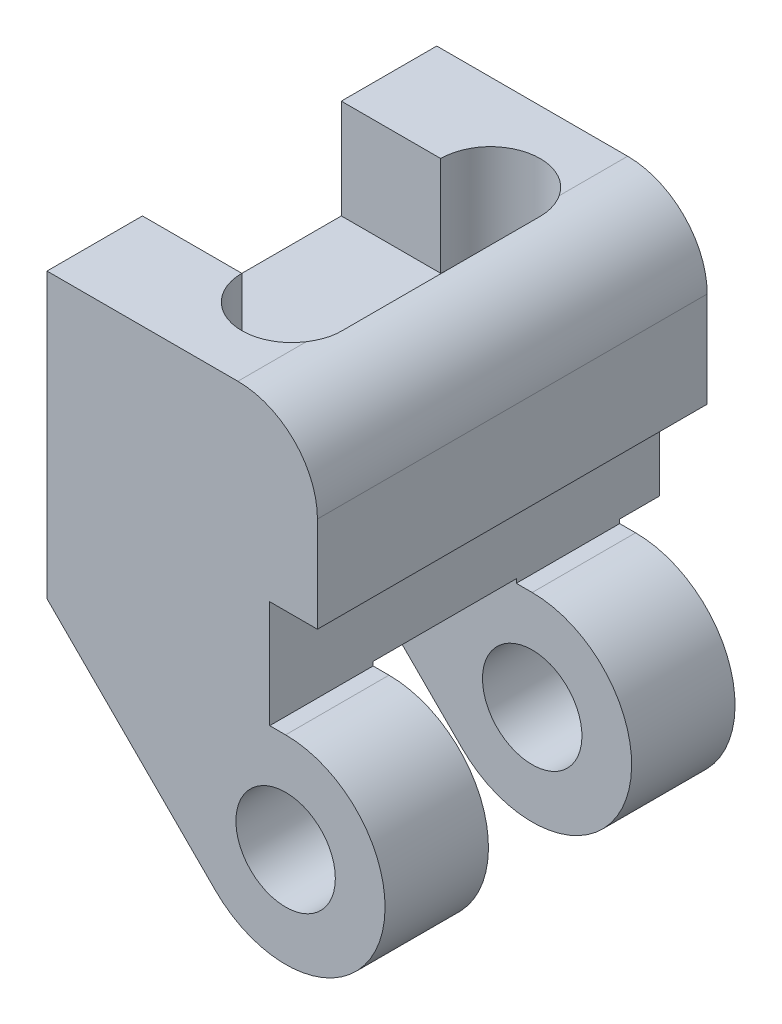
ISO-10303-21;
HEADER;
FILE_DESCRIPTION(('STEP AP214'),'2;1');
FILE_NAME('part.step','',(''),(''),'','','');
FILE_SCHEMA(('AUTOMOTIVE_DESIGN { 1 0 10303 214 1 1 1 1 }'));
ENDSEC;
DATA;
#1=APPLICATION_CONTEXT('core data for automotive mechanical design processes');
#2=APPLICATION_PROTOCOL_DEFINITION('international standard','automotive_design',2000,#1);
#3=PRODUCT_CONTEXT('',#1,'mechanical');
#4=PRODUCT('Part','Part','',(#3));
#5=PRODUCT_RELATED_PRODUCT_CATEGORY('part','',(#4));
#6=PRODUCT_DEFINITION_FORMATION('','',#4);
#7=PRODUCT_DEFINITION_CONTEXT('part definition',#1,'design');
#8=PRODUCT_DEFINITION('design','',#6,#7);
#9=PRODUCT_DEFINITION_SHAPE('','',#8);
#10=(LENGTH_UNIT() NAMED_UNIT(*) SI_UNIT(.MILLI.,.METRE.));
#11=(NAMED_UNIT(*) PLANE_ANGLE_UNIT() SI_UNIT($,.RADIAN.));
#12=(NAMED_UNIT(*) SI_UNIT($,.STERADIAN.) SOLID_ANGLE_UNIT());
#13=UNCERTAINTY_MEASURE_WITH_UNIT(LENGTH_MEASURE(1.E-05),#10,'distance_accuracy_value','');
#14=(GEOMETRIC_REPRESENTATION_CONTEXT(3) GLOBAL_UNCERTAINTY_ASSIGNED_CONTEXT((#13)) GLOBAL_UNIT_ASSIGNED_CONTEXT((#10,
#11,#12)) REPRESENTATION_CONTEXT('',''));
#15=CARTESIAN_POINT('',(0.,0.,0.));
#16=DIRECTION('',(0.,0.,1.));
#17=DIRECTION('',(1.,0.,0.));
#18=AXIS2_PLACEMENT_3D('',#15,#16,#17);
#19=CARTESIAN_POINT('',(-3.302,4.572,5.08));
#20=DIRECTION('',(0.,-1.,0.));
#21=DIRECTION('',(1.,0.,0.));
#22=AXIS2_PLACEMENT_3D('',#19,#20,#21);
#23=PLANE('',#22);
#24=DIRECTION('',(-1.,0.,0.));
#25=VECTOR('',#24,1.);
#26=CARTESIAN_POINT('',(-3.302,4.572,5.08));
#27=LINE('',#26,#25);
#28=CARTESIAN_POINT('',(-4.572,4.572,5.08));
#29=VERTEX_POINT('',#28);
#30=CARTESIAN_POINT('',(-7.62,4.572,5.08));
#31=VERTEX_POINT('',#30);
#32=EDGE_CURVE('E709',#29,#31,#27,.T.);
#33=ORIENTED_EDGE('',*,*,#32,.F.);
#34=DIRECTION('',(0.,0.,-1.));
#35=VECTOR('',#34,1.);
#36=CARTESIAN_POINT('',(-4.572,4.572,5.08));
#37=LINE('',#36,#35);
#38=CARTESIAN_POINT('',(-4.572,4.57200000000001,3.98667795392845));
#39=VERTEX_POINT('',#38);
#40=EDGE_CURVE('E598',#29,#39,#37,.T.);
#41=ORIENTED_EDGE('',*,*,#40,.T.);
#42=CARTESIAN_POINT('',(-5.23875,4.57200000000001,3.556));
#43=DIRECTION('',(0.,-1.,0.));
#44=DIRECTION('',(0.,0.,-1.));
#45=AXIS2_PLACEMENT_3D('',#42,#43,#44);
#46=CIRCLE('',#45,0.79375);
#47=CARTESIAN_POINT('',(-6.0325,4.57200000000001,3.556));
#48=VERTEX_POINT('',#47);
#49=EDGE_CURVE('E726',#39,#48,#46,.T.);
#50=ORIENTED_EDGE('',*,*,#49,.T.);
#51=DIRECTION('',(-1.,0.,0.));
#52=VECTOR('',#51,1.);
#53=CARTESIAN_POINT('',(-7.62,4.57200000000001,3.556));
#54=LINE('',#53,#52);
#55=CARTESIAN_POINT('',(-7.62,4.572,3.556));
#56=VERTEX_POINT('',#55);
#57=EDGE_CURVE('E881',#48,#56,#54,.T.);
#58=ORIENTED_EDGE('',*,*,#57,.T.);
#59=DIRECTION('',(0.,0.,-1.));
#60=VECTOR('',#59,1.);
#61=CARTESIAN_POINT('',(-7.62,4.572,5.08));
#62=LINE('',#61,#60);
#63=EDGE_CURVE('E562',#31,#56,#62,.T.);
#64=ORIENTED_EDGE('',*,*,#63,.F.);
#65=EDGE_LOOP('',(#33,#41,#50,#58,#64));
#66=FACE_BOUND('',#65,.T.);
#67=ADVANCED_FACE('F375',(#66),#23,.F.);
#68=CARTESIAN_POINT('',(-7.62,3.302,5.08));
#69=DIRECTION('',(1.,0.,0.));
#70=DIRECTION('',(0.,1.,0.));
#71=AXIS2_PLACEMENT_3D('',#68,#69,#70);
#72=PLANE('',#71);
#73=DIRECTION('',(0.,1.,0.));
#74=VECTOR('',#73,1.);
#75=CARTESIAN_POINT('',(-7.62,2.98450000000001,0.380999999999999));
#76=LINE('',#75,#74);
#77=CARTESIAN_POINT('',(-7.62,2.98450000000001,0.380999999999999));
#78=VERTEX_POINT('',#77);
#79=CARTESIAN_POINT('',(-7.62,4.57200000000001,0.380999999999999));
#80=VERTEX_POINT('',#79);
#81=EDGE_CURVE('E539',#78,#80,#76,.T.);
#82=ORIENTED_EDGE('',*,*,#81,.T.);
#83=CARTESIAN_POINT('',(-7.62,4.572,-1.143));
#84=VERTEX_POINT('',#83);
#85=EDGE_CURVE('E553',#80,#84,#62,.T.);
#86=ORIENTED_EDGE('',*,*,#85,.T.);
#87=DIRECTION('',(0.,-1.,0.));
#88=VECTOR('',#87,1.);
#89=CARTESIAN_POINT('',(-7.62,7.5222750118298,-1.143));
#90=LINE('',#89,#88);
#91=CARTESIAN_POINT('',(-7.62,0.127000000000001,-1.143));
#92=VERTEX_POINT('',#91);
#93=EDGE_CURVE('E790',#84,#92,#90,.T.);
#94=ORIENTED_EDGE('',*,*,#93,.T.);
#95=DIRECTION('',(0.,0.,-1.));
#96=VECTOR('',#95,1.);
#97=CARTESIAN_POINT('',(-7.62,0.127000000000001,5.08));
#98=LINE('',#97,#96);
#99=CARTESIAN_POINT('',(-7.62,0.127000000000001,-0.508));
#100=VERTEX_POINT('',#99);
#101=EDGE_CURVE('E749',#100,#92,#98,.T.);
#102=ORIENTED_EDGE('',*,*,#101,.F.);
#103=DIRECTION('',(0.,1.,0.));
#104=VECTOR('',#103,1.);
#105=CARTESIAN_POINT('',(-7.62,3.302,-0.508));
#106=LINE('',#105,#104);
#107=CARTESIAN_POINT('',(-7.62,0.0409359697327396,-0.508));
#108=VERTEX_POINT('',#107);
#109=EDGE_CURVE('E757',#108,#100,#106,.T.);
#110=ORIENTED_EDGE('',*,*,#109,.F.);
#111=DIRECTION('',(0.,0.,-1.));
#112=VECTOR('',#111,1.);
#113=CARTESIAN_POINT('',(-7.62,0.04093596973274,5.08));
#114=LINE('',#113,#112);
#115=CARTESIAN_POINT('',(-7.62,0.0409359697327396,1.143));
#116=VERTEX_POINT('',#115);
#117=EDGE_CURVE('E568',#116,#108,#114,.T.);
#118=ORIENTED_EDGE('',*,*,#117,.F.);
#119=DIRECTION('',(0.,1.,0.));
#120=VECTOR('',#119,1.);
#121=CARTESIAN_POINT('',(-7.62,3.302,1.143));
#122=LINE('',#121,#120);
#123=CARTESIAN_POINT('',(-7.62,0.127000000000001,1.143));
#124=VERTEX_POINT('',#123);
#125=EDGE_CURVE('E782',#116,#124,#122,.T.);
#126=ORIENTED_EDGE('',*,*,#125,.T.);
#127=DIRECTION('',(0.,0.,-1.));
#128=VECTOR('',#127,1.);
#129=CARTESIAN_POINT('',(-7.62,0.127000000000001,5.08));
#130=LINE('',#129,#128);
#131=CARTESIAN_POINT('',(-7.62,0.127000000000001,3.429));
#132=VERTEX_POINT('',#131);
#133=EDGE_CURVE('E577',#132,#124,#130,.T.);
#134=ORIENTED_EDGE('',*,*,#133,.F.);
#135=DIRECTION('',(0.,1.,0.));
#136=VECTOR('',#135,1.);
#137=CARTESIAN_POINT('',(-7.62,3.302,3.429));
#138=LINE('',#137,#136);
#139=CARTESIAN_POINT('',(-7.62,0.0409359697327396,3.429));
#140=VERTEX_POINT('',#139);
#141=EDGE_CURVE('E771',#140,#132,#138,.T.);
#142=ORIENTED_EDGE('',*,*,#141,.F.);
#143=CARTESIAN_POINT('',(-7.62,0.04093596973274,5.08));
#144=VERTEX_POINT('',#143);
#145=EDGE_CURVE('E563',#144,#140,#114,.T.);
#146=ORIENTED_EDGE('',*,*,#145,.F.);
#147=DIRECTION('',(0.,-1.,0.));
#148=VECTOR('',#147,1.);
#149=CARTESIAN_POINT('',(-7.62,4.572,5.08));
#150=LINE('',#149,#148);
#151=EDGE_CURVE('E714',#31,#144,#150,.T.);
#152=ORIENTED_EDGE('',*,*,#151,.F.);
#153=ORIENTED_EDGE('',*,*,#63,.T.);
#154=DIRECTION('',(0.,1.,0.));
#155=VECTOR('',#154,1.);
#156=CARTESIAN_POINT('',(-7.62,2.98450000000001,3.556));
#157=LINE('',#156,#155);
#158=CARTESIAN_POINT('',(-7.62,2.98450000000001,3.556));
#159=VERTEX_POINT('',#158);
#160=EDGE_CURVE('E736',#159,#56,#157,.T.);
#161=ORIENTED_EDGE('',*,*,#160,.F.);
#162=DIRECTION('',(0.,0.,-1.));
#163=VECTOR('',#162,1.);
#164=CARTESIAN_POINT('',(-7.62,2.98450000000001,3.556));
#165=LINE('',#164,#163);
#166=EDGE_CURVE('E557',#159,#78,#165,.T.);
#167=ORIENTED_EDGE('',*,*,#166,.T.);
#168=EDGE_LOOP('',(#82,#86,#94,#102,#110,#118,#126,#134,#142,#146,#152,#153,#161,#167));
#169=FACE_BOUND('',#168,.T.);
#170=ADVANCED_FACE('F551',(#169),#72,.F.);
#171=CARTESIAN_POINT('',(-5.23875,4.57200000000001,0.380999999999999));
#172=DIRECTION('',(0.,-1.,0.));
#173=DIRECTION('',(0.,0.,1.));
#174=AXIS2_PLACEMENT_3D('',#171,#172,#173);
#175=CIRCLE('',#174,0.79375);
#176=CARTESIAN_POINT('',(-6.0325,4.57200000000001,0.380999999999999));
#177=VERTEX_POINT('',#176);
#178=CARTESIAN_POINT('',(-4.572,4.57200000000001,-0.0496779539284517));
#179=VERTEX_POINT('',#178);
#180=EDGE_CURVE('E547',#177,#179,#175,.T.);
#181=ORIENTED_EDGE('',*,*,#180,.T.);
#182=DIRECTION('',(0.,0.,-1.));
#183=VECTOR('',#182,1.);
#184=CARTESIAN_POINT('',(-4.572,4.572,5.08));
#185=LINE('',#184,#183);
#186=CARTESIAN_POINT('',(-4.572,4.572,-1.143));
#187=VERTEX_POINT('',#186);
#188=EDGE_CURVE('E591',#179,#187,#185,.T.);
#189=ORIENTED_EDGE('',*,*,#188,.T.);
#190=DIRECTION('',(-1.,0.,0.));
#191=VECTOR('',#190,1.);
#192=CARTESIAN_POINT('',(-3.302,4.572,-1.143));
#193=LINE('',#192,#191);
#194=EDGE_CURVE('E561',#187,#84,#193,.T.);
#195=ORIENTED_EDGE('',*,*,#194,.T.);
#196=ORIENTED_EDGE('',*,*,#85,.F.);
#197=DIRECTION('',(1.,0.,0.));
#198=VECTOR('',#197,1.);
#199=CARTESIAN_POINT('',(-6.0325,4.57200000000001,0.380999999999999));
#200=LINE('',#199,#198);
#201=EDGE_CURVE('E536',#80,#177,#200,.T.);
#202=ORIENTED_EDGE('',*,*,#201,.T.);
#203=EDGE_LOOP('',(#181,#189,#195,#196,#202));
#204=FACE_BOUND('',#203,.T.);
#205=ADVANCED_FACE('F560',(#204),#23,.F.);
#206=CARTESIAN_POINT('',(-4.064,1.778,5.08));
#207=DIRECTION('',(-1.,0.,0.));
#208=DIRECTION('',(0.,0.,1.));
#209=AXIS2_PLACEMENT_3D('',#206,#207,#208);
#210=PLANE('',#209);
#211=DIRECTION('',(0.,0.,1.));
#212=VECTOR('',#211,1.);
#213=CARTESIAN_POINT('',(-4.064,0.127000000000001,5.08));
#214=LINE('',#213,#212);
#215=CARTESIAN_POINT('',(-4.064,0.127000000000001,-1.143));
#216=VERTEX_POINT('',#215);
#217=CARTESIAN_POINT('',(-4.064,0.127000000000001,-0.508));
#218=VERTEX_POINT('',#217);
#219=EDGE_CURVE('E596',#216,#218,#214,.T.);
#220=ORIENTED_EDGE('',*,*,#219,.F.);
#221=DIRECTION('',(0.,1.,0.));
#222=VECTOR('',#221,1.);
#223=CARTESIAN_POINT('',(-4.064,1.778,-1.143));
#224=LINE('',#223,#222);
#225=CARTESIAN_POINT('',(-4.064,1.778,-1.143));
#226=VERTEX_POINT('',#225);
#227=EDGE_CURVE('E792',#216,#226,#224,.T.);
#228=ORIENTED_EDGE('',*,*,#227,.T.);
#229=DIRECTION('',(0.,0.,-1.));
#230=VECTOR('',#229,1.);
#231=CARTESIAN_POINT('',(-4.064,1.778,5.08));
#232=LINE('',#231,#230);
#233=CARTESIAN_POINT('',(-4.064,1.778,5.08));
#234=VERTEX_POINT('',#233);
#235=EDGE_CURVE('E574',#234,#226,#232,.T.);
#236=ORIENTED_EDGE('',*,*,#235,.F.);
#237=DIRECTION('',(0.,1.,0.));
#238=VECTOR('',#237,1.);
#239=CARTESIAN_POINT('',(-4.064,1.778,5.08));
#240=LINE('',#239,#238);
#241=CARTESIAN_POINT('',(-4.064,0.0635,5.08));
#242=VERTEX_POINT('',#241);
#243=EDGE_CURVE('E803',#242,#234,#240,.T.);
#244=ORIENTED_EDGE('',*,*,#243,.F.);
#245=DIRECTION('',(0.,0.,-1.));
#246=VECTOR('',#245,1.);
#247=CARTESIAN_POINT('',(-4.064,0.0635,5.08));
#248=LINE('',#247,#246);
#249=CARTESIAN_POINT('',(-4.064,0.0635,3.429));
#250=VERTEX_POINT('',#249);
#251=EDGE_CURVE('E817',#242,#250,#248,.T.);
#252=ORIENTED_EDGE('',*,*,#251,.T.);
#253=DIRECTION('',(0.,-1.,0.));
#254=VECTOR('',#253,1.);
#255=CARTESIAN_POINT('',(-4.064,1.778,3.429));
#256=LINE('',#255,#254);
#257=CARTESIAN_POINT('',(-4.064,0.127000000000001,3.429));
#258=VERTEX_POINT('',#257);
#259=EDGE_CURVE('E587',#258,#250,#256,.T.);
#260=ORIENTED_EDGE('',*,*,#259,.F.);
#261=DIRECTION('',(0.,0.,1.));
#262=VECTOR('',#261,1.);
#263=CARTESIAN_POINT('',(-4.064,0.127000000000001,5.08));
#264=LINE('',#263,#262);
#265=CARTESIAN_POINT('',(-4.064,0.127000000000001,1.143));
#266=VERTEX_POINT('',#265);
#267=EDGE_CURVE('E788',#266,#258,#264,.T.);
#268=ORIENTED_EDGE('',*,*,#267,.F.);
#269=DIRECTION('',(0.,-1.,0.));
#270=VECTOR('',#269,1.);
#271=CARTESIAN_POINT('',(-4.064,1.778,1.143));
#272=LINE('',#271,#270);
#273=CARTESIAN_POINT('',(-4.064,0.0635,1.143));
#274=VERTEX_POINT('',#273);
#275=EDGE_CURVE('E785',#266,#274,#272,.T.);
#276=ORIENTED_EDGE('',*,*,#275,.T.);
#277=CARTESIAN_POINT('',(-4.064,0.0635,-0.508));
#278=VERTEX_POINT('',#277);
#279=EDGE_CURVE('E816',#274,#278,#248,.T.);
#280=ORIENTED_EDGE('',*,*,#279,.T.);
#281=DIRECTION('',(0.,-1.,0.));
#282=VECTOR('',#281,1.);
#283=CARTESIAN_POINT('',(-4.064,1.778,-0.508));
#284=LINE('',#283,#282);
#285=EDGE_CURVE('E759',#218,#278,#284,.T.);
#286=ORIENTED_EDGE('',*,*,#285,.F.);
#287=EDGE_LOOP('',(#220,#228,#236,#244,#252,#260,#268,#276,#280,#286));
#288=FACE_BOUND('',#287,.T.);
#289=ADVANCED_FACE('F377',(#288),#210,.F.);
#290=CARTESIAN_POINT('',(-4.93253201513365,-2.64653201513364,5.08));
#291=DIRECTION('',(0.707106781186551,0.707106781186544,0.));
#292=DIRECTION('',(-0.707106781186544,0.707106781186551,0.));
#293=AXIS2_PLACEMENT_3D('',#290,#291,#292);
#294=PLANE('',#293);
#295=DIRECTION('',(-0.707106781186544,0.707106781186551,0.));
#296=VECTOR('',#295,1.);
#297=CARTESIAN_POINT('',(-4.93253201513365,-2.64653201513364,-0.508));
#298=LINE('',#297,#296);
#299=CARTESIAN_POINT('',(-4.93253201513365,-2.64653201513364,-0.508));
#300=VERTEX_POINT('',#299);
#301=EDGE_CURVE('E755',#300,#108,#298,.T.);
#302=ORIENTED_EDGE('',*,*,#301,.F.);
#303=DIRECTION('',(0.,0.,-1.));
#304=VECTOR('',#303,1.);
#305=CARTESIAN_POINT('',(-4.93253201513365,-2.64653201513364,5.08));
#306=LINE('',#305,#304);
#307=CARTESIAN_POINT('',(-4.93253201513365,-2.64653201513364,1.143));
#308=VERTEX_POINT('',#307);
#309=EDGE_CURVE('E823',#308,#300,#306,.T.);
#310=ORIENTED_EDGE('',*,*,#309,.F.);
#311=DIRECTION('',(-0.707106781186544,0.707106781186551,0.));
#312=VECTOR('',#311,1.);
#313=CARTESIAN_POINT('',(-4.93253201513365,-2.64653201513364,1.143));
#314=LINE('',#313,#312);
#315=EDGE_CURVE('E779',#308,#116,#314,.T.);
#316=ORIENTED_EDGE('',*,*,#315,.T.);
#317=ORIENTED_EDGE('',*,*,#117,.T.);
#318=EDGE_LOOP('',(#302,#310,#316,#317));
#319=FACE_BOUND('',#318,.T.);
#320=ADVANCED_FACE('F686',(#319),#294,.F.);
#321=CARTESIAN_POINT('',(-3.81,-1.524,5.08));
#322=DIRECTION('',(0.,0.,-1.));
#323=DIRECTION('',(-1.,0.,0.));
#324=AXIS2_PLACEMENT_3D('',#321,#322,#323);
#325=CYLINDRICAL_SURFACE('',#324,1.5875);
#326=CARTESIAN_POINT('',(-3.81,-1.524,-0.508));
#327=DIRECTION('',(0.,0.,-1.));
#328=DIRECTION('',(-1.,0.,0.));
#329=AXIS2_PLACEMENT_3D('',#326,#327,#328);
#330=CIRCLE('',#329,1.5875);
#331=CARTESIAN_POINT('',(-3.81,0.0635,-0.508));
#332=VERTEX_POINT('',#331);
#333=EDGE_CURVE('E753',#332,#300,#330,.T.);
#334=ORIENTED_EDGE('',*,*,#333,.F.);
#335=DIRECTION('',(0.,0.,-1.));
#336=VECTOR('',#335,1.);
#337=CARTESIAN_POINT('',(-3.81,0.0634999999999993,5.08));
#338=LINE('',#337,#336);
#339=CARTESIAN_POINT('',(-3.81,0.0635,1.143));
#340=VERTEX_POINT('',#339);
#341=EDGE_CURVE('E820',#340,#332,#338,.T.);
#342=ORIENTED_EDGE('',*,*,#341,.F.);
#343=CARTESIAN_POINT('',(-3.81,-1.524,1.143));
#344=DIRECTION('',(0.,0.,-1.));
#345=DIRECTION('',(0.,1.,0.));
#346=AXIS2_PLACEMENT_3D('',#343,#344,#345);
#347=CIRCLE('',#346,1.5875);
#348=EDGE_CURVE('E776',#340,#308,#347,.T.);
#349=ORIENTED_EDGE('',*,*,#348,.T.);
#350=ORIENTED_EDGE('',*,*,#309,.T.);
#351=EDGE_LOOP('',(#334,#342,#349,#350));
#352=FACE_BOUND('',#351,.T.);
#353=ADVANCED_FACE('F681',(#352),#325,.T.);
#354=CARTESIAN_POINT('',(-4.064,0.0635,5.08));
#355=DIRECTION('',(0.,-1.,0.));
#356=DIRECTION('',(0.,0.,-1.));
#357=AXIS2_PLACEMENT_3D('',#354,#355,#356);
#358=PLANE('',#357);
#359=DIRECTION('',(1.,0.,0.));
#360=VECTOR('',#359,1.);
#361=CARTESIAN_POINT('',(-4.064,0.0635,-0.508));
#362=LINE('',#361,#360);
#363=EDGE_CURVE('E595',#278,#332,#362,.T.);
#364=ORIENTED_EDGE('',*,*,#363,.F.);
#365=ORIENTED_EDGE('',*,*,#279,.F.);
#366=DIRECTION('',(1.,0.,0.));
#367=VECTOR('',#366,1.);
#368=CARTESIAN_POINT('',(-4.064,0.0635,1.143));
#369=LINE('',#368,#367);
#370=EDGE_CURVE('E586',#274,#340,#369,.T.);
#371=ORIENTED_EDGE('',*,*,#370,.T.);
#372=ORIENTED_EDGE('',*,*,#341,.T.);
#373=EDGE_LOOP('',(#364,#365,#371,#372));
#374=FACE_BOUND('',#373,.T.);
#375=ADVANCED_FACE('F671',(#374),#358,.F.);
#376=CARTESIAN_POINT('',(-3.81,-1.524,5.08));
#377=DIRECTION('',(0.,0.,-1.));
#378=DIRECTION('',(-1.,0.,0.));
#379=AXIS2_PLACEMENT_3D('',#376,#377,#378);
#380=CYLINDRICAL_SURFACE('',#379,0.793750000000003);
#381=CARTESIAN_POINT('',(-3.81,-1.524,1.143));
#382=DIRECTION('',(0.,0.,-1.));
#383=DIRECTION('',(0.,1.,0.));
#384=AXIS2_PLACEMENT_3D('',#381,#382,#383);
#385=CIRCLE('',#384,0.793750000000003);
#386=CARTESIAN_POINT('',(-3.81,-0.730249999999997,1.143));
#387=VERTEX_POINT('',#386);
#388=EDGE_CURVE('E583',#387,#387,#385,.T.);
#389=ORIENTED_EDGE('',*,*,#388,.F.);
#390=EDGE_LOOP('',(#389));
#391=FACE_BOUND('',#390,.T.);
#392=CARTESIAN_POINT('',(-3.81,-1.524,-0.508));
#393=DIRECTION('',(0.,0.,-1.));
#394=DIRECTION('',(-1.,0.,0.));
#395=AXIS2_PLACEMENT_3D('',#392,#393,#394);
#396=CIRCLE('',#395,0.793750000000003);
#397=CARTESIAN_POINT('',(-4.60375,-1.524,-0.508));
#398=VERTEX_POINT('',#397);
#399=EDGE_CURVE('E592',#398,#398,#396,.T.);
#400=ORIENTED_EDGE('',*,*,#399,.T.);
#401=EDGE_LOOP('',(#400));
#402=FACE_BOUND('',#401,.T.);
#403=ADVANCED_FACE('F668',(#391,#402),#380,.F.);
#404=CARTESIAN_POINT('',(-7.62,7.5222750118298,-1.143));
#405=DIRECTION('',(0.,0.,1.));
#406=DIRECTION('',(0.,-1.,0.));
#407=AXIS2_PLACEMENT_3D('',#404,#405,#406);
#408=PLANE('',#407);
#409=ORIENTED_EDGE('',*,*,#194,.F.);
#410=CARTESIAN_POINT('',(-4.572,3.302,-1.143));
#411=DIRECTION('',(0.,0.,1.));
#412=DIRECTION('',(0.,-1.,0.));
#413=AXIS2_PLACEMENT_3D('',#410,#411,#412);
#414=CIRCLE('',#413,1.27);
#415=CARTESIAN_POINT('',(-3.302,3.302,-1.143));
#416=VERTEX_POINT('',#415);
#417=EDGE_CURVE('E397',#187,#416,#414,.F.);
#418=ORIENTED_EDGE('',*,*,#417,.T.);
#419=DIRECTION('',(0.,1.,0.));
#420=VECTOR('',#419,1.);
#421=CARTESIAN_POINT('',(-3.302,3.302,-1.143));
#422=LINE('',#421,#420);
#423=CARTESIAN_POINT('',(-3.302,1.778,-1.143));
#424=VERTEX_POINT('',#423);
#425=EDGE_CURVE('E797',#424,#416,#422,.T.);
#426=ORIENTED_EDGE('',*,*,#425,.F.);
#427=DIRECTION('',(1.,0.,0.));
#428=VECTOR('',#427,1.);
#429=CARTESIAN_POINT('',(-4.064,1.778,-1.143));
#430=LINE('',#429,#428);
#431=EDGE_CURVE('E794',#226,#424,#430,.T.);
#432=ORIENTED_EDGE('',*,*,#431,.F.);
#433=ORIENTED_EDGE('',*,*,#227,.F.);
#434=DIRECTION('',(1.,0.,0.));
#435=VECTOR('',#434,1.);
#436=CARTESIAN_POINT('',(-7.62,0.127000000000001,-1.143));
#437=LINE('',#436,#435);
#438=EDGE_CURVE('E589',#92,#216,#437,.T.);
#439=ORIENTED_EDGE('',*,*,#438,.F.);
#440=ORIENTED_EDGE('',*,*,#93,.F.);
#441=EDGE_LOOP('',(#409,#418,#426,#432,#433,#439,#440));
#442=FACE_BOUND('',#441,.T.);
#443=ADVANCED_FACE('F664',(#442),#408,.F.);
#444=DIRECTION('',(-0.707106781186544,0.707106781186551,0.));
#445=VECTOR('',#444,1.);
#446=CARTESIAN_POINT('',(-4.93253201513365,-2.64653201513364,3.429));
#447=LINE('',#446,#445);
#448=CARTESIAN_POINT('',(-4.93253201513365,-2.64653201513364,3.429));
#449=VERTEX_POINT('',#448);
#450=EDGE_CURVE('E769',#449,#140,#447,.T.);
#451=ORIENTED_EDGE('',*,*,#450,.F.);
#452=CARTESIAN_POINT('',(-4.93253201513365,-2.64653201513364,5.08));
#453=VERTEX_POINT('',#452);
#454=EDGE_CURVE('E824',#453,#449,#306,.T.);
#455=ORIENTED_EDGE('',*,*,#454,.F.);
#456=DIRECTION('',(0.707106781186544,-0.707106781186551,0.));
#457=VECTOR('',#456,1.);
#458=CARTESIAN_POINT('',(-4.93253201513365,-2.64653201513364,5.08));
#459=LINE('',#458,#457);
#460=EDGE_CURVE('E810',#144,#453,#459,.T.);
#461=ORIENTED_EDGE('',*,*,#460,.F.);
#462=ORIENTED_EDGE('',*,*,#145,.T.);
#463=EDGE_LOOP('',(#451,#455,#461,#462));
#464=FACE_BOUND('',#463,.T.);
#465=ADVANCED_FACE('F667',(#464),#294,.F.);
#466=CARTESIAN_POINT('',(-3.81,-1.524,3.429));
#467=DIRECTION('',(0.,0.,-1.));
#468=DIRECTION('',(0.,1.,0.));
#469=AXIS2_PLACEMENT_3D('',#466,#467,#468);
#470=CIRCLE('',#469,1.5875);
#471=CARTESIAN_POINT('',(-3.81,0.0635,3.429));
#472=VERTEX_POINT('',#471);
#473=EDGE_CURVE('E767',#472,#449,#470,.T.);
#474=ORIENTED_EDGE('',*,*,#473,.F.);
#475=CARTESIAN_POINT('',(-3.81,0.0634999999999993,5.08));
#476=VERTEX_POINT('',#475);
#477=EDGE_CURVE('E821',#476,#472,#338,.T.);
#478=ORIENTED_EDGE('',*,*,#477,.F.);
#479=CARTESIAN_POINT('',(-3.81,-1.524,5.08));
#480=DIRECTION('',(0.,0.,1.));
#481=DIRECTION('',(-1.,0.,0.));
#482=AXIS2_PLACEMENT_3D('',#479,#480,#481);
#483=CIRCLE('',#482,1.5875);
#484=EDGE_CURVE('E812',#453,#476,#483,.T.);
#485=ORIENTED_EDGE('',*,*,#484,.F.);
#486=ORIENTED_EDGE('',*,*,#454,.T.);
#487=EDGE_LOOP('',(#474,#478,#485,#486));
#488=FACE_BOUND('',#487,.T.);
#489=ADVANCED_FACE('F688',(#488),#325,.T.);
#490=DIRECTION('',(1.,0.,0.));
#491=VECTOR('',#490,1.);
#492=CARTESIAN_POINT('',(-4.064,0.0635,3.429));
#493=LINE('',#492,#491);
#494=EDGE_CURVE('E581',#250,#472,#493,.T.);
#495=ORIENTED_EDGE('',*,*,#494,.F.);
#496=ORIENTED_EDGE('',*,*,#251,.F.);
#497=DIRECTION('',(-1.,0.,0.));
#498=VECTOR('',#497,1.);
#499=CARTESIAN_POINT('',(-4.064,0.0635,5.08));
#500=LINE('',#499,#498);
#501=EDGE_CURVE('E814',#476,#242,#500,.T.);
#502=ORIENTED_EDGE('',*,*,#501,.F.);
#503=ORIENTED_EDGE('',*,*,#477,.T.);
#504=EDGE_LOOP('',(#495,#496,#502,#503));
#505=FACE_BOUND('',#504,.T.);
#506=ADVANCED_FACE('F683',(#505),#358,.F.);
#507=CARTESIAN_POINT('',(-3.81,-1.524,5.08));
#508=DIRECTION('',(0.,0.,1.));
#509=DIRECTION('',(1.,0.,0.));
#510=AXIS2_PLACEMENT_3D('',#507,#508,#509);
#511=CIRCLE('',#510,0.793750000000003);
#512=CARTESIAN_POINT('',(-3.01625,-1.524,5.08));
#513=VERTEX_POINT('',#512);
#514=EDGE_CURVE('E800',#513,#513,#511,.T.);
#515=ORIENTED_EDGE('',*,*,#514,.T.);
#516=EDGE_LOOP('',(#515));
#517=FACE_BOUND('',#516,.T.);
#518=CARTESIAN_POINT('',(-3.81,-1.524,3.429));
#519=DIRECTION('',(0.,0.,-1.));
#520=DIRECTION('',(0.,1.,0.));
#521=AXIS2_PLACEMENT_3D('',#518,#519,#520);
#522=CIRCLE('',#521,0.793750000000003);
#523=CARTESIAN_POINT('',(-3.81,-0.730249999999997,3.429));
#524=VERTEX_POINT('',#523);
#525=EDGE_CURVE('E578',#524,#524,#522,.T.);
#526=ORIENTED_EDGE('',*,*,#525,.T.);
#527=EDGE_LOOP('',(#526));
#528=FACE_BOUND('',#527,.T.);
#529=ADVANCED_FACE('F673',(#517,#528),#380,.F.);
#530=CARTESIAN_POINT('',(-3.81,-1.524,5.08));
#531=DIRECTION('',(0.,0.,-1.));
#532=DIRECTION('',(-1.,0.,0.));
#533=AXIS2_PLACEMENT_3D('',#530,#531,#532);
#534=PLANE('',#533);
#535=DIRECTION('',(0.,1.,0.));
#536=VECTOR('',#535,1.);
#537=CARTESIAN_POINT('',(-3.302,1.778,5.08));
#538=LINE('',#537,#536);
#539=CARTESIAN_POINT('',(-3.302,1.778,5.08));
#540=VERTEX_POINT('',#539);
#541=CARTESIAN_POINT('',(-3.302,3.302,5.08));
#542=VERTEX_POINT('',#541);
#543=EDGE_CURVE('E715',#540,#542,#538,.T.);
#544=ORIENTED_EDGE('',*,*,#543,.T.);
#545=CARTESIAN_POINT('',(-4.572,3.302,5.08));
#546=DIRECTION('',(0.,0.,-1.));
#547=DIRECTION('',(-1.,0.,0.));
#548=AXIS2_PLACEMENT_3D('',#545,#546,#547);
#549=CIRCLE('',#548,1.27);
#550=EDGE_CURVE('E12',#542,#29,#549,.F.);
#551=ORIENTED_EDGE('',*,*,#550,.T.);
#552=ORIENTED_EDGE('',*,*,#32,.T.);
#553=ORIENTED_EDGE('',*,*,#151,.T.);
#554=ORIENTED_EDGE('',*,*,#460,.T.);
#555=ORIENTED_EDGE('',*,*,#484,.T.);
#556=ORIENTED_EDGE('',*,*,#501,.T.);
#557=ORIENTED_EDGE('',*,*,#243,.T.);
#558=DIRECTION('',(1.,0.,0.));
#559=VECTOR('',#558,1.);
#560=CARTESIAN_POINT('',(-4.064,1.778,5.08));
#561=LINE('',#560,#559);
#562=EDGE_CURVE('E806',#234,#540,#561,.T.);
#563=ORIENTED_EDGE('',*,*,#562,.T.);
#564=EDGE_LOOP('',(#544,#551,#552,#553,#554,#555,#556,#557,#563));
#565=FACE_BOUND('',#564,.T.);
#566=ORIENTED_EDGE('',*,*,#514,.F.);
#567=EDGE_LOOP('',(#566));
#568=FACE_BOUND('',#567,.T.);
#569=ADVANCED_FACE('F674',(#565,#568),#534,.F.);
#570=CARTESIAN_POINT('',(-4.064,1.778,5.08));
#571=DIRECTION('',(0.,1.,0.));
#572=DIRECTION('',(-1.,0.,0.));
#573=AXIS2_PLACEMENT_3D('',#570,#571,#572);
#574=PLANE('',#573);
#575=ORIENTED_EDGE('',*,*,#235,.T.);
#576=ORIENTED_EDGE('',*,*,#431,.T.);
#577=DIRECTION('',(0.,0.,-1.));
#578=VECTOR('',#577,1.);
#579=CARTESIAN_POINT('',(-3.302,1.778,5.08));
#580=LINE('',#579,#578);
#581=EDGE_CURVE('E566',#540,#424,#580,.T.);
#582=ORIENTED_EDGE('',*,*,#581,.F.);
#583=ORIENTED_EDGE('',*,*,#562,.F.);
#584=EDGE_LOOP('',(#575,#576,#582,#583));
#585=FACE_BOUND('',#584,.T.);
#586=ADVANCED_FACE('F677',(#585),#574,.F.);
#587=CARTESIAN_POINT('',(-3.302,3.302,5.08));
#588=DIRECTION('',(-1.,0.,0.));
#589=DIRECTION('',(0.,0.,1.));
#590=AXIS2_PLACEMENT_3D('',#587,#588,#589);
#591=PLANE('',#590);
#592=ORIENTED_EDGE('',*,*,#425,.T.);
#593=DIRECTION('',(0.,0.,-1.));
#594=VECTOR('',#593,1.);
#595=CARTESIAN_POINT('',(-3.302,3.302,5.08));
#596=LINE('',#595,#594);
#597=EDGE_CURVE('E383',#416,#542,#596,.F.);
#598=ORIENTED_EDGE('',*,*,#597,.T.);
#599=ORIENTED_EDGE('',*,*,#543,.F.);
#600=ORIENTED_EDGE('',*,*,#581,.T.);
#601=EDGE_LOOP('',(#592,#598,#599,#600));
#602=FACE_BOUND('',#601,.T.);
#603=ADVANCED_FACE('F662',(#602),#591,.F.);
#604=CARTESIAN_POINT('',(-9.74051606002074,0.127000000000001,1.143));
#605=DIRECTION('',(0.,-1.,0.));
#606=DIRECTION('',(0.,0.,-1.));
#607=AXIS2_PLACEMENT_3D('',#604,#605,#606);
#608=PLANE('',#607);
#609=CARTESIAN_POINT('',(-5.715,0.127000000000001,1.778));
#610=DIRECTION('',(0.,-1.,0.));
#611=DIRECTION('',(0.,0.,-1.));
#612=AXIS2_PLACEMENT_3D('',#609,#610,#611);
#613=CIRCLE('',#612,0.508);
#614=CARTESIAN_POINT('',(-5.715,0.127000000000001,1.27));
#615=VERTEX_POINT('',#614);
#616=EDGE_CURVE('E558',#615,#615,#613,.T.);
#617=ORIENTED_EDGE('',*,*,#616,.F.);
#618=EDGE_LOOP('',(#617));
#619=FACE_BOUND('',#618,.T.);
#620=ORIENTED_EDGE('',*,*,#267,.T.);
#621=DIRECTION('',(1.,0.,0.));
#622=VECTOR('',#621,1.);
#623=CARTESIAN_POINT('',(-9.74051606002074,0.127000000000001,3.429));
#624=LINE('',#623,#622);
#625=EDGE_CURVE('E761',#132,#258,#624,.T.);
#626=ORIENTED_EDGE('',*,*,#625,.F.);
#627=ORIENTED_EDGE('',*,*,#133,.T.);
#628=DIRECTION('',(1.,0.,0.));
#629=VECTOR('',#628,1.);
#630=CARTESIAN_POINT('',(-9.74051606002074,0.127000000000001,1.143));
#631=LINE('',#630,#629);
#632=EDGE_CURVE('E582',#124,#266,#631,.T.);
#633=ORIENTED_EDGE('',*,*,#632,.T.);
#634=EDGE_LOOP('',(#620,#626,#627,#633));
#635=FACE_BOUND('',#634,.T.);
#636=ADVANCED_FACE('F658',(#619,#635),#608,.T.);
#637=CARTESIAN_POINT('',(-9.74051606002074,0.127000000000001,1.143));
#638=DIRECTION('',(0.,0.,-1.));
#639=DIRECTION('',(0.,1.,0.));
#640=AXIS2_PLACEMENT_3D('',#637,#638,#639);
#641=PLANE('',#640);
#642=ORIENTED_EDGE('',*,*,#388,.T.);
#643=EDGE_LOOP('',(#642));
#644=FACE_BOUND('',#643,.T.);
#645=ORIENTED_EDGE('',*,*,#632,.F.);
#646=ORIENTED_EDGE('',*,*,#125,.F.);
#647=ORIENTED_EDGE('',*,*,#315,.F.);
#648=ORIENTED_EDGE('',*,*,#348,.F.);
#649=ORIENTED_EDGE('',*,*,#370,.F.);
#650=ORIENTED_EDGE('',*,*,#275,.F.);
#651=EDGE_LOOP('',(#645,#646,#647,#648,#649,#650));
#652=FACE_BOUND('',#651,.T.);
#653=ADVANCED_FACE('F654',(#644,#652),#641,.F.);
#654=CARTESIAN_POINT('',(-9.74051606002074,0.127000000000001,3.429));
#655=DIRECTION('',(0.,0.,-1.));
#656=DIRECTION('',(0.,1.,0.));
#657=AXIS2_PLACEMENT_3D('',#654,#655,#656);
#658=PLANE('',#657);
#659=ORIENTED_EDGE('',*,*,#525,.F.);
#660=EDGE_LOOP('',(#659));
#661=FACE_BOUND('',#660,.T.);
#662=ORIENTED_EDGE('',*,*,#259,.T.);
#663=ORIENTED_EDGE('',*,*,#494,.T.);
#664=ORIENTED_EDGE('',*,*,#473,.T.);
#665=ORIENTED_EDGE('',*,*,#450,.T.);
#666=ORIENTED_EDGE('',*,*,#141,.T.);
#667=ORIENTED_EDGE('',*,*,#625,.T.);
#668=EDGE_LOOP('',(#662,#663,#664,#665,#666,#667));
#669=FACE_BOUND('',#668,.T.);
#670=ADVANCED_FACE('F647',(#661,#669),#658,.T.);
#671=CARTESIAN_POINT('',(-12.5598636984989,0.127000000000001,-0.508));
#672=DIRECTION('',(0.,0.,-1.));
#673=DIRECTION('',(-1.,0.,0.));
#674=AXIS2_PLACEMENT_3D('',#671,#672,#673);
#675=PLANE('',#674);
#676=ORIENTED_EDGE('',*,*,#399,.F.);
#677=EDGE_LOOP('',(#676));
#678=FACE_BOUND('',#677,.T.);
#679=ORIENTED_EDGE('',*,*,#285,.T.);
#680=ORIENTED_EDGE('',*,*,#363,.T.);
#681=ORIENTED_EDGE('',*,*,#333,.T.);
#682=ORIENTED_EDGE('',*,*,#301,.T.);
#683=ORIENTED_EDGE('',*,*,#109,.T.);
#684=DIRECTION('',(-1.,0.,0.));
#685=VECTOR('',#684,1.);
#686=CARTESIAN_POINT('',(-12.5598636984989,0.127000000000001,-0.508));
#687=LINE('',#686,#685);
#688=EDGE_CURVE('E746',#218,#100,#687,.T.);
#689=ORIENTED_EDGE('',*,*,#688,.F.);
#690=EDGE_LOOP('',(#679,#680,#681,#682,#683,#689));
#691=FACE_BOUND('',#690,.T.);
#692=ADVANCED_FACE('F644',(#678,#691),#675,.T.);
#693=CARTESIAN_POINT('',(-12.5598636984989,0.127000000000001,-0.508));
#694=DIRECTION('',(0.,-1.,0.));
#695=DIRECTION('',(0.,0.,-1.));
#696=AXIS2_PLACEMENT_3D('',#693,#694,#695);
#697=PLANE('',#696);
#698=ORIENTED_EDGE('',*,*,#219,.T.);
#699=ORIENTED_EDGE('',*,*,#688,.T.);
#700=ORIENTED_EDGE('',*,*,#101,.T.);
#701=ORIENTED_EDGE('',*,*,#438,.T.);
#702=EDGE_LOOP('',(#698,#699,#700,#701));
#703=FACE_BOUND('',#702,.T.);
#704=ADVANCED_FACE('F642',(#703),#697,.T.);
#705=CARTESIAN_POINT('',(-5.715,2.667,1.778));
#706=DIRECTION('',(0.,-1.,0.));
#707=DIRECTION('',(0.,0.,-1.));
#708=AXIS2_PLACEMENT_3D('',#705,#706,#707);
#709=CYLINDRICAL_SURFACE('',#708,0.508);
#710=CARTESIAN_POINT('',(-5.715,2.667,1.778));
#711=DIRECTION('',(0.,-1.,0.));
#712=DIRECTION('',(0.,0.,-1.));
#713=AXIS2_PLACEMENT_3D('',#710,#711,#712);
#714=CIRCLE('',#713,0.508);
#715=CARTESIAN_POINT('',(-5.715,2.667,1.27));
#716=VERTEX_POINT('',#715);
#717=EDGE_CURVE('E743',#716,#716,#714,.T.);
#718=ORIENTED_EDGE('',*,*,#717,.F.);
#719=EDGE_LOOP('',(#718));
#720=FACE_BOUND('',#719,.T.);
#721=ORIENTED_EDGE('',*,*,#616,.T.);
#722=EDGE_LOOP('',(#721));
#723=FACE_BOUND('',#722,.T.);
#724=ADVANCED_FACE('F638',(#720,#723),#709,.F.);
#725=CARTESIAN_POINT('',(-5.715,2.667,1.778));
#726=DIRECTION('',(0.,-1.,0.));
#727=DIRECTION('',(0.,0.,-1.));
#728=AXIS2_PLACEMENT_3D('',#725,#726,#727);
#729=PLANE('',#728);
#730=ORIENTED_EDGE('',*,*,#717,.T.);
#731=EDGE_LOOP('',(#730));
#732=FACE_BOUND('',#731,.T.);
#733=ADVANCED_FACE('F635',(#732),#729,.T.);
#734=CARTESIAN_POINT('',(-6.0325,2.98450000000001,0.380999999999999));
#735=DIRECTION('',(0.,0.,1.));
#736=DIRECTION('',(1.,0.,0.));
#737=AXIS2_PLACEMENT_3D('',#734,#735,#736);
#738=PLANE('',#737);
#739=ORIENTED_EDGE('',*,*,#201,.F.);
#740=ORIENTED_EDGE('',*,*,#81,.F.);
#741=DIRECTION('',(1.,0.,0.));
#742=VECTOR('',#741,1.);
#743=CARTESIAN_POINT('',(-6.0325,2.98450000000001,0.380999999999999));
#744=LINE('',#743,#742);
#745=CARTESIAN_POINT('',(-6.0325,2.98450000000001,0.380999999999999));
#746=VERTEX_POINT('',#745);
#747=EDGE_CURVE('E878',#78,#746,#744,.T.);
#748=ORIENTED_EDGE('',*,*,#747,.T.);
#749=DIRECTION('',(0.,1.,0.));
#750=VECTOR('',#749,1.);
#751=CARTESIAN_POINT('',(-6.0325,2.98450000000001,0.380999999999999));
#752=LINE('',#751,#750);
#753=EDGE_CURVE('E542',#746,#177,#752,.T.);
#754=ORIENTED_EDGE('',*,*,#753,.T.);
#755=EDGE_LOOP('',(#739,#740,#748,#754));
#756=FACE_BOUND('',#755,.T.);
#757=ADVANCED_FACE('F538',(#756),#738,.T.);
#758=CARTESIAN_POINT('',(-5.23875,2.98450000000001,0.380999999999999));
#759=DIRECTION('',(0.,1.,0.));
#760=DIRECTION('',(0.,0.,1.));
#761=AXIS2_PLACEMENT_3D('',#758,#759,#760);
#762=CYLINDRICAL_SURFACE('',#761,0.79375);
#763=DIRECTION('',(0.,1.,0.));
#764=VECTOR('',#763,1.);
#765=CARTESIAN_POINT('',(-4.445,2.98450000000001,0.381));
#766=LINE('',#765,#764);
#767=CARTESIAN_POINT('',(-4.445,2.98450000000001,0.381));
#768=VERTEX_POINT('',#767);
#769=CARTESIAN_POINT('',(-4.445,4.56563404512541,0.381));
#770=VERTEX_POINT('',#769);
#771=EDGE_CURVE('E732',#768,#770,#766,.T.);
#772=ORIENTED_EDGE('',*,*,#771,.T.);
#773=CARTESIAN_POINT('',(-4.445,4.56563404512541,0.381));
#774=CARTESIAN_POINT('',(-4.4450004844147,4.5656303984611,0.358432712776229));
#775=CARTESIAN_POINT('',(-4.44596314345864,4.56573119218662,0.335878264804764));
#776=CARTESIAN_POINT('',(-4.44980362418333,4.56610983616957,0.290932120872655));
#777=CARTESIAN_POINT('',(-4.45268164704677,4.56638770502618,0.268540442258489));
#778=CARTESIAN_POINT('',(-4.46398707984517,4.56742197914101,0.20291134432807));
#779=CARTESIAN_POINT('',(-4.47508907259905,4.568382166006,0.160101395344258));
#780=CARTESIAN_POINT('',(-4.49990752710999,4.56999309940195,0.0892520952039484));
#781=CARTESIAN_POINT('',(-4.51188411163495,4.57065150157677,0.060583768348125));
#782=CARTESIAN_POINT('',(-4.53933571140463,4.57165338955345,0.00436429271292559));
#783=CARTESIAN_POINT('',(-4.55486662679033,4.57199134371151,-0.0231596546023797));
#784=CARTESIAN_POINT('',(-4.572,4.572,-0.0496779539284517));
#785=B_SPLINE_CURVE_WITH_KNOTS('',3,(#773,#774,#775,#776,#777,#778,#779,#780,#781,#782,#783,
#784),.UNSPECIFIED.,.F.,.F.,(4,2,2,2,2,4),(0.,0.0676557001479344,0.135318507720486,
0.267330864658574,0.360364182095196,0.454975697212423),.UNSPECIFIED.);
#786=EDGE_CURVE('E621',#770,#179,#785,.T.);
#787=ORIENTED_EDGE('',*,*,#786,.T.);
#788=ORIENTED_EDGE('',*,*,#180,.F.);
#789=ORIENTED_EDGE('',*,*,#753,.F.);
#790=CARTESIAN_POINT('',(-5.23875,2.98450000000001,0.380999999999999));
#791=DIRECTION('',(0.,-1.,0.));
#792=DIRECTION('',(0.,0.,1.));
#793=AXIS2_PLACEMENT_3D('',#790,#791,#792);
#794=CIRCLE('',#793,0.79375);
#795=EDGE_CURVE('E876',#746,#768,#794,.T.);
#796=ORIENTED_EDGE('',*,*,#795,.T.);
#797=EDGE_LOOP('',(#772,#787,#788,#789,#796));
#798=FACE_BOUND('',#797,.T.);
#799=ADVANCED_FACE('F627',(#798),#762,.F.);
#800=CARTESIAN_POINT('',(-4.445,2.98450000000001,3.556));
#801=DIRECTION('',(-1.,0.,0.));
#802=DIRECTION('',(0.,0.,1.));
#803=AXIS2_PLACEMENT_3D('',#800,#801,#802);
#804=PLANE('',#803);
#805=DIRECTION('',(0.,1.,0.));
#806=VECTOR('',#805,1.);
#807=CARTESIAN_POINT('',(-4.445,2.98450000000001,3.556));
#808=LINE('',#807,#806);
#809=CARTESIAN_POINT('',(-4.445,2.98450000000001,3.556));
#810=VERTEX_POINT('',#809);
#811=CARTESIAN_POINT('',(-4.445,4.56563404512541,3.556));
#812=VERTEX_POINT('',#811);
#813=EDGE_CURVE('E723',#810,#812,#808,.T.);
#814=ORIENTED_EDGE('',*,*,#813,.T.);
#815=DIRECTION('',(0.,0.,-1.));
#816=VECTOR('',#815,1.);
#817=CARTESIAN_POINT('',(-4.445,4.56563404512541,3.556));
#818=LINE('',#817,#816);
#819=EDGE_CURVE('E608',#812,#770,#818,.T.);
#820=ORIENTED_EDGE('',*,*,#819,.T.);
#821=ORIENTED_EDGE('',*,*,#771,.F.);
#822=DIRECTION('',(0.,0.,1.));
#823=VECTOR('',#822,1.);
#824=CARTESIAN_POINT('',(-4.445,2.98450000000001,3.556));
#825=LINE('',#824,#823);
#826=EDGE_CURVE('E731',#768,#810,#825,.T.);
#827=ORIENTED_EDGE('',*,*,#826,.T.);
#828=EDGE_LOOP('',(#814,#820,#821,#827));
#829=FACE_BOUND('',#828,.T.);
#830=ADVANCED_FACE('F631',(#829),#804,.T.);
#831=CARTESIAN_POINT('',(-5.23875,2.98450000000001,3.556));
#832=DIRECTION('',(0.,1.,0.));
#833=DIRECTION('',(0.,0.,1.));
#834=AXIS2_PLACEMENT_3D('',#831,#832,#833);
#835=CYLINDRICAL_SURFACE('',#834,0.79375);
#836=ORIENTED_EDGE('',*,*,#49,.F.);
#837=CARTESIAN_POINT('',(-4.572,4.57200000000001,3.98667795392845));
#838=CARTESIAN_POINT('',(-4.55975473654474,4.57199834180669,3.96771952195727));
#839=CARTESIAN_POINT('',(-4.54832541319857,4.57182315421195,3.94825097980385));
#840=CARTESIAN_POINT('',(-4.52716436625746,4.5712527310161,3.90841242849842));
#841=CARTESIAN_POINT('',(-4.5174328228752,4.57085747207392,3.88804232393644));
#842=CARTESIAN_POINT('',(-4.49132102724222,4.56955388337107,3.82678205037969));
#843=CARTESIAN_POINT('',(-4.47741861997623,4.56851508677905,3.78479935094274));
#844=CARTESIAN_POINT('',(-4.45982401040781,4.5670575588903,3.71181777698968));
#845=CARTESIAN_POINT('',(-4.45432904009917,4.56654630750175,3.681236451022));
#846=CARTESIAN_POINT('',(-4.44688416128013,4.56582356912731,3.61911557255955));
#847=CARTESIAN_POINT('',(-4.44499593852661,4.56561731158198,3.58756856460095));
#848=CARTESIAN_POINT('',(-4.445,4.56563404512541,3.556));
#849=B_SPLINE_CURVE_WITH_KNOTS('',3,(#837,#838,#839,#840,#841,#842,#843,#844,#845,#846,#847,
#848),.UNSPECIFIED.,.F.,.F.,(4,2,2,2,2,4),(0.,0.0676590658994291,0.135325309179528,
0.267339579895295,0.36036914837765,0.454976022818294),.UNSPECIFIED.);
#850=EDGE_CURVE('E601',#39,#812,#849,.T.);
#851=ORIENTED_EDGE('',*,*,#850,.T.);
#852=ORIENTED_EDGE('',*,*,#813,.F.);
#853=CARTESIAN_POINT('',(-5.23875,2.98450000000001,3.556));
#854=DIRECTION('',(0.,-1.,0.));
#855=DIRECTION('',(0.,0.,-1.));
#856=AXIS2_PLACEMENT_3D('',#853,#854,#855);
#857=CIRCLE('',#856,0.79375);
#858=CARTESIAN_POINT('',(-6.0325,2.98450000000001,3.556));
#859=VERTEX_POINT('',#858);
#860=EDGE_CURVE('E871',#810,#859,#857,.T.);
#861=ORIENTED_EDGE('',*,*,#860,.T.);
#862=DIRECTION('',(0.,1.,0.));
#863=VECTOR('',#862,1.);
#864=CARTESIAN_POINT('',(-6.0325,2.98450000000001,3.556));
#865=LINE('',#864,#863);
#866=EDGE_CURVE('E733',#859,#48,#865,.T.);
#867=ORIENTED_EDGE('',*,*,#866,.T.);
#868=EDGE_LOOP('',(#836,#851,#852,#861,#867));
#869=FACE_BOUND('',#868,.T.);
#870=ADVANCED_FACE('F610',(#869),#835,.F.);
#871=CARTESIAN_POINT('',(-7.62,2.98450000000001,3.556));
#872=DIRECTION('',(0.,0.,-1.));
#873=DIRECTION('',(-1.,0.,0.));
#874=AXIS2_PLACEMENT_3D('',#871,#872,#873);
#875=PLANE('',#874);
#876=ORIENTED_EDGE('',*,*,#57,.F.);
#877=ORIENTED_EDGE('',*,*,#866,.F.);
#878=DIRECTION('',(-1.,0.,0.));
#879=VECTOR('',#878,1.);
#880=CARTESIAN_POINT('',(-7.62,2.98450000000001,3.556));
#881=LINE('',#880,#879);
#882=EDGE_CURVE('E870',#859,#159,#881,.T.);
#883=ORIENTED_EDGE('',*,*,#882,.T.);
#884=ORIENTED_EDGE('',*,*,#160,.T.);
#885=EDGE_LOOP('',(#876,#877,#883,#884));
#886=FACE_BOUND('',#885,.T.);
#887=ADVANCED_FACE('F889',(#886),#875,.T.);
#888=CARTESIAN_POINT('',(-5.23875,2.98450000000001,0.380999999999999));
#889=DIRECTION('',(0.,1.,0.));
#890=DIRECTION('',(0.,0.,1.));
#891=AXIS2_PLACEMENT_3D('',#888,#889,#890);
#892=PLANE('',#891);
#893=ORIENTED_EDGE('',*,*,#166,.F.);
#894=ORIENTED_EDGE('',*,*,#882,.F.);
#895=ORIENTED_EDGE('',*,*,#860,.F.);
#896=ORIENTED_EDGE('',*,*,#826,.F.);
#897=ORIENTED_EDGE('',*,*,#795,.F.);
#898=ORIENTED_EDGE('',*,*,#747,.F.);
#899=EDGE_LOOP('',(#893,#894,#895,#896,#897,#898));
#900=FACE_BOUND('',#899,.T.);
#901=ADVANCED_FACE('F618',(#900),#892,.T.);
#902=CARTESIAN_POINT('',(-4.572,3.302,5.08));
#903=DIRECTION('',(0.,0.,-1.));
#904=DIRECTION('',(-1.,0.,0.));
#905=AXIS2_PLACEMENT_3D('',#902,#903,#904);
#906=CYLINDRICAL_SURFACE('',#905,1.27);
#907=ORIENTED_EDGE('',*,*,#550,.F.);
#908=ORIENTED_EDGE('',*,*,#597,.F.);
#909=ORIENTED_EDGE('',*,*,#417,.F.);
#910=ORIENTED_EDGE('',*,*,#188,.F.);
#911=ORIENTED_EDGE('',*,*,#786,.F.);
#912=ORIENTED_EDGE('',*,*,#819,.F.);
#913=ORIENTED_EDGE('',*,*,#850,.F.);
#914=ORIENTED_EDGE('',*,*,#40,.F.);
#915=EDGE_LOOP('',(#907,#908,#909,#910,#911,#912,#913,#914));
#916=FACE_BOUND('',#915,.T.);
#917=ADVANCED_FACE('F614',(#916),#906,.T.);
#918=CLOSED_SHELL('',(#67,#170,#205,#289,#320,#353,#375,#403,#443,#465,#489,#506,#529,#569,#586,
#603,#636,#653,#670,#692,#704,#724,#733,#757,#799,#830,#870,#887,#901,#917));
#919=MANIFOLD_SOLID_BREP('B2',#918);
#920=ADVANCED_BREP_SHAPE_REPRESENTATION('',(#18,#919),#14);
#921=SHAPE_DEFINITION_REPRESENTATION(#9,#920);
ENDSEC;
END-ISO-10303-21;
